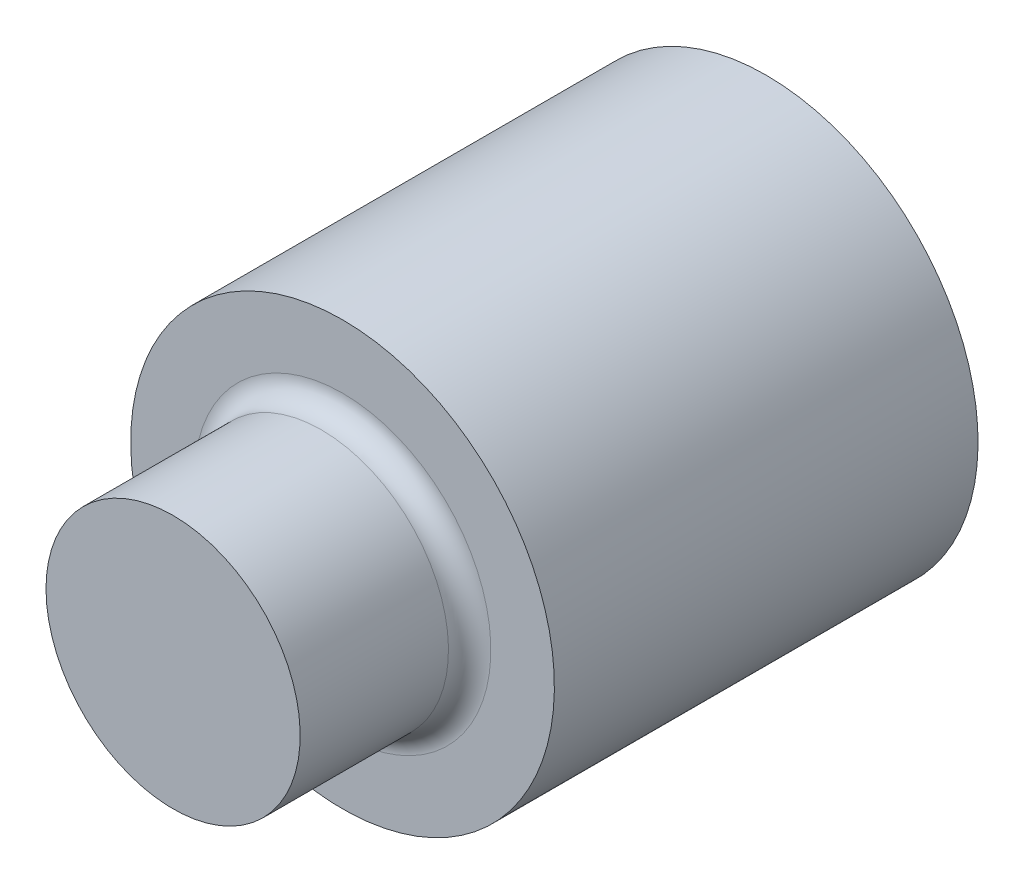
ISO-10303-21;
HEADER;
FILE_DESCRIPTION(('STEP AP214'),'2;1');
FILE_NAME('part.step','',(''),(''),'','','');
FILE_SCHEMA(('AUTOMOTIVE_DESIGN { 1 0 10303 214 1 1 1 1 }'));
ENDSEC;
DATA;
#1=APPLICATION_CONTEXT('core data for automotive mechanical design processes');
#2=APPLICATION_PROTOCOL_DEFINITION('international standard','automotive_design',2000,#1);
#3=PRODUCT_CONTEXT('',#1,'mechanical');
#4=PRODUCT('Part','Part','',(#3));
#5=PRODUCT_RELATED_PRODUCT_CATEGORY('part','',(#4));
#6=PRODUCT_DEFINITION_FORMATION('','',#4);
#7=PRODUCT_DEFINITION_CONTEXT('part definition',#1,'design');
#8=PRODUCT_DEFINITION('design','',#6,#7);
#9=PRODUCT_DEFINITION_SHAPE('','',#8);
#10=(LENGTH_UNIT() NAMED_UNIT(*) SI_UNIT(.MILLI.,.METRE.));
#11=(NAMED_UNIT(*) PLANE_ANGLE_UNIT() SI_UNIT($,.RADIAN.));
#12=(NAMED_UNIT(*) SI_UNIT($,.STERADIAN.) SOLID_ANGLE_UNIT());
#13=UNCERTAINTY_MEASURE_WITH_UNIT(LENGTH_MEASURE(1.E-05),#10,'distance_accuracy_value','');
#14=(GEOMETRIC_REPRESENTATION_CONTEXT(3) GLOBAL_UNCERTAINTY_ASSIGNED_CONTEXT((#13)) GLOBAL_UNIT_ASSIGNED_CONTEXT((#10,
#11,#12)) REPRESENTATION_CONTEXT('',''));
#15=CARTESIAN_POINT('',(0.,0.,0.));
#16=DIRECTION('',(0.,0.,1.));
#17=DIRECTION('',(1.,0.,0.));
#18=AXIS2_PLACEMENT_3D('',#15,#16,#17);
#19=CARTESIAN_POINT('',(0.,2.50000000000001,-34.));
#20=DIRECTION('',(0.,0.,-1.));
#21=DIRECTION('',(0.,1.,0.));
#22=AXIS2_PLACEMENT_3D('',#19,#20,#21);
#23=PLANE('',#22);
#24=CARTESIAN_POINT('',(0.,0.,-34.));
#25=DIRECTION('',(0.,0.,-1.));
#26=DIRECTION('',(0.,1.,0.));
#27=AXIS2_PLACEMENT_3D('',#24,#25,#26);
#28=CIRCLE('',#27,2.50000000000001);
#29=CARTESIAN_POINT('',(0.,2.50000000000001,-34.));
#30=VERTEX_POINT('',#29);
#31=EDGE_CURVE('E10',#30,#30,#28,.T.);
#32=ORIENTED_EDGE('',*,*,#31,.T.);
#33=EDGE_LOOP('',(#32));
#34=FACE_BOUND('',#33,.T.);
#35=ADVANCED_FACE('F31',(#34),#23,.T.);
#36=CARTESIAN_POINT('',(0.,0.,-34.));
#37=DIRECTION('',(0.,0.,-1.));
#38=DIRECTION('',(0.,1.,0.));
#39=AXIS2_PLACEMENT_3D('',#36,#37,#38);
#40=CYLINDRICAL_SURFACE('',#39,2.50000000000001);
#41=CARTESIAN_POINT('',(0.,0.,-29.));
#42=DIRECTION('',(0.,0.,-1.));
#43=DIRECTION('',(0.,1.,0.));
#44=AXIS2_PLACEMENT_3D('',#41,#42,#43);
#45=CIRCLE('',#44,2.50000000000001);
#46=CARTESIAN_POINT('',(0.,2.50000000000001,-29.));
#47=VERTEX_POINT('',#46);
#48=EDGE_CURVE('E38',#47,#47,#45,.T.);
#49=ORIENTED_EDGE('',*,*,#48,.T.);
#50=EDGE_LOOP('',(#49));
#51=FACE_BOUND('',#50,.T.);
#52=ORIENTED_EDGE('',*,*,#31,.F.);
#53=EDGE_LOOP('',(#52));
#54=FACE_BOUND('',#53,.T.);
#55=ADVANCED_FACE('F69',(#51,#54),#40,.T.);
#56=CARTESIAN_POINT('',(0.,1.74999999999999,-29.));
#57=DIRECTION('',(0.,0.,1.));
#58=DIRECTION('',(0.,-1.,0.));
#59=AXIS2_PLACEMENT_3D('',#56,#57,#58);
#60=PLANE('',#59);
#61=CARTESIAN_POINT('',(0.,0.,-29.));
#62=DIRECTION('',(0.,0.,-1.));
#63=DIRECTION('',(0.,1.,0.));
#64=AXIS2_PLACEMENT_3D('',#61,#62,#63);
#65=CIRCLE('',#64,1.75);
#66=CARTESIAN_POINT('',(0.,1.74999999999999,-29.));
#67=VERTEX_POINT('',#66);
#68=EDGE_CURVE('E42',#67,#67,#65,.T.);
#69=ORIENTED_EDGE('',*,*,#68,.T.);
#70=EDGE_LOOP('',(#69));
#71=FACE_BOUND('',#70,.T.);
#72=ORIENTED_EDGE('',*,*,#48,.F.);
#73=EDGE_LOOP('',(#72));
#74=FACE_BOUND('',#73,.T.);
#75=ADVANCED_FACE('F66',(#71,#74),#60,.T.);
#76=CARTESIAN_POINT('',(0.,0.,-28.75));
#77=DIRECTION('',(0.,0.,-1.));
#78=DIRECTION('',(0.,1.,0.));
#79=AXIS2_PLACEMENT_3D('',#76,#77,#78);
#80=TOROIDAL_SURFACE('',#79,1.75,0.25);
#81=CARTESIAN_POINT('',(0.,0.,-28.75));
#82=DIRECTION('',(0.,0.,-1.));
#83=DIRECTION('',(0.,1.,0.));
#84=AXIS2_PLACEMENT_3D('',#81,#82,#83);
#85=CIRCLE('',#84,1.5);
#86=CARTESIAN_POINT('',(0.,1.49999999999999,-28.75));
#87=VERTEX_POINT('',#86);
#88=EDGE_CURVE('E47',#87,#87,#85,.T.);
#89=ORIENTED_EDGE('',*,*,#88,.T.);
#90=EDGE_LOOP('',(#89));
#91=FACE_BOUND('',#90,.T.);
#92=ORIENTED_EDGE('',*,*,#68,.F.);
#93=EDGE_LOOP('',(#92));
#94=FACE_BOUND('',#93,.T.);
#95=ADVANCED_FACE('F59',(#91,#94),#80,.F.);
#96=CARTESIAN_POINT('',(0.,0.,-34.));
#97=DIRECTION('',(0.,0.,-1.));
#98=DIRECTION('',(0.,1.,0.));
#99=AXIS2_PLACEMENT_3D('',#96,#97,#98);
#100=CYLINDRICAL_SURFACE('',#99,1.5);
#101=CARTESIAN_POINT('',(0.,0.,-27.));
#102=DIRECTION('',(0.,0.,-1.));
#103=DIRECTION('',(-1.,0.,0.));
#104=AXIS2_PLACEMENT_3D('',#101,#102,#103);
#105=CIRCLE('',#104,1.5);
#106=CARTESIAN_POINT('',(-1.5,0.,-27.));
#107=VERTEX_POINT('',#106);
#108=EDGE_CURVE('E34',#107,#107,#105,.F.);
#109=ORIENTED_EDGE('',*,*,#108,.F.);
#110=EDGE_LOOP('',(#109));
#111=FACE_BOUND('',#110,.T.);
#112=ORIENTED_EDGE('',*,*,#88,.F.);
#113=EDGE_LOOP('',(#112));
#114=FACE_BOUND('',#113,.T.);
#115=ADVANCED_FACE('F56',(#111,#114),#100,.T.);
#116=CARTESIAN_POINT('',(-2.50000000000001,2.69813581358846,-27.));
#117=DIRECTION('',(0.,0.,-1.));
#118=DIRECTION('',(-1.,0.,0.));
#119=AXIS2_PLACEMENT_3D('',#116,#117,#118);
#120=PLANE('',#119);
#121=ORIENTED_EDGE('',*,*,#108,.T.);
#122=EDGE_LOOP('',(#121));
#123=FACE_BOUND('',#122,.T.);
#124=ADVANCED_FACE('F54',(#123),#120,.F.);
#125=CLOSED_SHELL('',(#35,#55,#75,#95,#115,#124));
#126=MANIFOLD_SOLID_BREP('B2',#125);
#127=ADVANCED_BREP_SHAPE_REPRESENTATION('',(#18,#126),#14);
#128=SHAPE_DEFINITION_REPRESENTATION(#9,#127);
ENDSEC;
END-ISO-10303-21;
